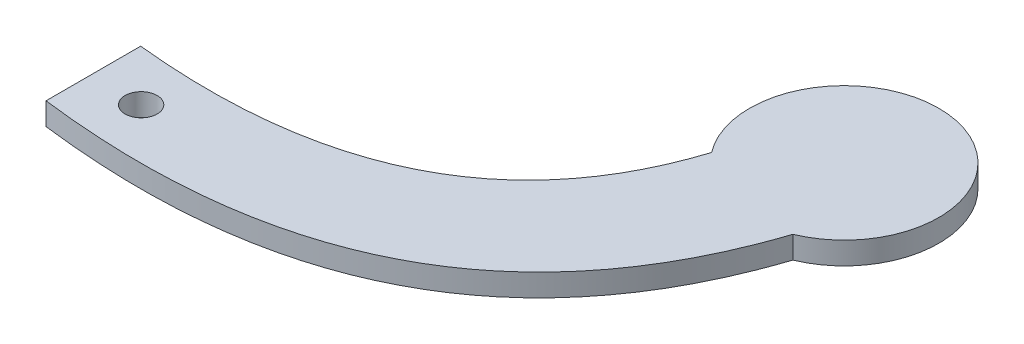
ISO-10303-21;
HEADER;
FILE_DESCRIPTION(('STEP AP214'),'2;1');
FILE_NAME('part.step','',(''),(''),'','','');
FILE_SCHEMA(('AUTOMOTIVE_DESIGN { 1 0 10303 214 1 1 1 1 }'));
ENDSEC;
DATA;
#1=APPLICATION_CONTEXT('core data for automotive mechanical design processes');
#2=APPLICATION_PROTOCOL_DEFINITION('international standard','automotive_design',2000,#1);
#3=PRODUCT_CONTEXT('',#1,'mechanical');
#4=PRODUCT('Part','Part','',(#3));
#5=PRODUCT_RELATED_PRODUCT_CATEGORY('part','',(#4));
#6=PRODUCT_DEFINITION_FORMATION('','',#4);
#7=PRODUCT_DEFINITION_CONTEXT('part definition',#1,'design');
#8=PRODUCT_DEFINITION('design','',#6,#7);
#9=PRODUCT_DEFINITION_SHAPE('','',#8);
#10=(LENGTH_UNIT() NAMED_UNIT(*) SI_UNIT(.MILLI.,.METRE.));
#11=(NAMED_UNIT(*) PLANE_ANGLE_UNIT() SI_UNIT($,.RADIAN.));
#12=(NAMED_UNIT(*) SI_UNIT($,.STERADIAN.) SOLID_ANGLE_UNIT());
#13=UNCERTAINTY_MEASURE_WITH_UNIT(LENGTH_MEASURE(1.E-05),#10,'distance_accuracy_value','');
#14=(GEOMETRIC_REPRESENTATION_CONTEXT(3) GLOBAL_UNCERTAINTY_ASSIGNED_CONTEXT((#13)) GLOBAL_UNIT_ASSIGNED_CONTEXT((#10,
#11,#12)) REPRESENTATION_CONTEXT('',''));
#15=CARTESIAN_POINT('',(0.,0.,0.));
#16=DIRECTION('',(0.,0.,1.));
#17=DIRECTION('',(1.,0.,0.));
#18=AXIS2_PLACEMENT_3D('',#15,#16,#17);
#19=CARTESIAN_POINT('',(14.2474531183386,3.,-35.0628266390555));
#20=CARTESIAN_POINT('',(6.48797833639178,3.,0.323288204531436));
#21=CARTESIAN_POINT('',(-37.6970430623458,3.,-4.28102058144157));
#22=B_SPLINE_CURVE_WITH_KNOTS('',2,(#19,#20,#21),.UNSPECIFIED.,.F.,.F.,(3,3),(0.,1.),.UNSPECIFIED.);
#23=DIRECTION('',(0.,-1.,0.));
#24=VECTOR('',#23,1.);
#25=SURFACE_OF_LINEAR_EXTRUSION('',#22,#24);
#26=DIRECTION('',(0.,-1.,0.));
#27=VECTOR('',#26,1.);
#28=CARTESIAN_POINT('',(12.956353612177,3.,-30.2218807816706));
#29=LINE('',#28,#27);
#30=CARTESIAN_POINT('',(12.956353612177,0.,-30.2218807816706));
#31=VERTEX_POINT('',#30);
#32=CARTESIAN_POINT('',(12.956353612177,3.,-30.2218807816706));
#33=VERTEX_POINT('',#32);
#34=EDGE_CURVE('E89',#31,#33,#29,.F.);
#35=ORIENTED_EDGE('',*,*,#34,.F.);
#36=CARTESIAN_POINT('',(14.2474531183386,0.,-35.0628266390555));
#37=CARTESIAN_POINT('',(6.48797833639178,0.,0.323288204531436));
#38=CARTESIAN_POINT('',(-37.6970430623458,0.,-4.28102058144157));
#39=B_SPLINE_CURVE_WITH_KNOTS('',2,(#36,#37,#38),.UNSPECIFIED.,.F.,.F.,(3,3),(0.,1.),.UNSPECIFIED.);
#40=CARTESIAN_POINT('',(-37.6970430623458,0.,-4.28102058144157));
#41=VERTEX_POINT('',#40);
#42=EDGE_CURVE('E87',#31,#41,#39,.T.);
#43=ORIENTED_EDGE('',*,*,#42,.T.);
#44=DIRECTION('',(0.,-1.,0.));
#45=VECTOR('',#44,1.);
#46=CARTESIAN_POINT('',(-37.6970430623458,3.,-4.28102058144157));
#47=LINE('',#46,#45);
#48=CARTESIAN_POINT('',(-37.6970430623458,3.,-4.28102058144157));
#49=VERTEX_POINT('',#48);
#50=EDGE_CURVE('E11',#49,#41,#47,.T.);
#51=ORIENTED_EDGE('',*,*,#50,.F.);
#52=EDGE_CURVE('E56',#33,#49,#22,.T.);
#53=ORIENTED_EDGE('',*,*,#52,.F.);
#54=EDGE_LOOP('',(#35,#43,#51,#53));
#55=FACE_BOUND('',#54,.T.);
#56=ADVANCED_FACE('F33',(#55),#25,.F.);
#57=CARTESIAN_POINT('',(-37.6970430623458,3.,8.41897941855843));
#58=CARTESIAN_POINT('',(17.3808980967986,3.,15.2774008467738));
#59=CARTESIAN_POINT('',(29.3686874513966,3.,-31.1236815606959));
#60=B_SPLINE_CURVE_WITH_KNOTS('',2,(#57,#58,#59),.UNSPECIFIED.,.F.,.F.,(3,3),(0.,1.),.UNSPECIFIED.);
#61=DIRECTION('',(0.,-1.,0.));
#62=VECTOR('',#61,1.);
#63=SURFACE_OF_LINEAR_EXTRUSION('',#60,#62);
#64=DIRECTION('',(0.,-1.,0.));
#65=VECTOR('',#64,1.);
#66=CARTESIAN_POINT('',(27.9183458636867,3.,-26.1766246286806));
#67=LINE('',#66,#65);
#68=CARTESIAN_POINT('',(27.9183458636867,3.,-26.1766246286806));
#69=VERTEX_POINT('',#68);
#70=CARTESIAN_POINT('',(27.9183458636867,0.,-26.1766246286806));
#71=VERTEX_POINT('',#70);
#72=EDGE_CURVE('E48',#69,#71,#67,.T.);
#73=ORIENTED_EDGE('',*,*,#72,.F.);
#74=CARTESIAN_POINT('',(-37.6970430623458,3.,8.41897941855843));
#75=VERTEX_POINT('',#74);
#76=EDGE_CURVE('E84',#75,#69,#60,.T.);
#77=ORIENTED_EDGE('',*,*,#76,.F.);
#78=DIRECTION('',(0.,-1.,0.));
#79=VECTOR('',#78,1.);
#80=CARTESIAN_POINT('',(-37.6970430623458,3.,8.41897941855843));
#81=LINE('',#80,#79);
#82=CARTESIAN_POINT('',(-37.6970430623458,0.,8.41897941855843));
#83=VERTEX_POINT('',#82);
#84=EDGE_CURVE('E41',#75,#83,#81,.T.);
#85=ORIENTED_EDGE('',*,*,#84,.T.);
#86=CARTESIAN_POINT('',(-37.6970430623458,0.,8.41897941855843));
#87=CARTESIAN_POINT('',(17.3808980967986,0.,15.2774008467738));
#88=CARTESIAN_POINT('',(29.3686874513966,0.,-31.1236815606959));
#89=B_SPLINE_CURVE_WITH_KNOTS('',2,(#86,#87,#88),.UNSPECIFIED.,.F.,.F.,(3,3),(0.,1.),.UNSPECIFIED.);
#90=EDGE_CURVE('E80',#83,#71,#89,.T.);
#91=ORIENTED_EDGE('',*,*,#90,.T.);
#92=EDGE_LOOP('',(#73,#77,#85,#91));
#93=FACE_BOUND('',#92,.T.);
#94=ADVANCED_FACE('F114',(#93),#63,.F.);
#95=CARTESIAN_POINT('',(-37.6970430623458,3.,-4.28102058144157));
#96=DIRECTION('',(1.,0.,0.));
#97=DIRECTION('',(0.,0.,-1.));
#98=AXIS2_PLACEMENT_3D('',#95,#96,#97);
#99=PLANE('',#98);
#100=DIRECTION('',(0.,0.,1.));
#101=VECTOR('',#100,1.);
#102=CARTESIAN_POINT('',(-37.6970430623458,0.,-4.28102058144157));
#103=LINE('',#102,#101);
#104=EDGE_CURVE('E93',#41,#83,#103,.T.);
#105=ORIENTED_EDGE('',*,*,#104,.T.);
#106=ORIENTED_EDGE('',*,*,#84,.F.);
#107=DIRECTION('',(0.,0.,1.));
#108=VECTOR('',#107,1.);
#109=CARTESIAN_POINT('',(-37.6970430623458,3.,-4.28102058144157));
#110=LINE('',#109,#108);
#111=EDGE_CURVE('E76',#49,#75,#110,.T.);
#112=ORIENTED_EDGE('',*,*,#111,.F.);
#113=ORIENTED_EDGE('',*,*,#50,.T.);
#114=EDGE_LOOP('',(#105,#106,#112,#113));
#115=FACE_BOUND('',#114,.T.);
#116=ADVANCED_FACE('F82',(#115),#99,.F.);
#117=CARTESIAN_POINT('',(-2.61840831780591,3.,-9.67431770285855));
#118=DIRECTION('',(0.,-1.,0.));
#119=DIRECTION('',(0.,0.,-1.));
#120=AXIS2_PLACEMENT_3D('',#117,#118,#119);
#121=PLANE('',#120);
#122=CARTESIAN_POINT('',(-30.8552036088178,3.,2.49606383489245));
#123=DIRECTION('',(0.,1.,0.));
#124=DIRECTION('',(0.,0.,1.));
#125=AXIS2_PLACEMENT_3D('',#122,#123,#124);
#126=CIRCLE('',#125,2.15265);
#127=CARTESIAN_POINT('',(-30.8552036088178,3.,4.64871383489245));
#128=VERTEX_POINT('',#127);
#129=EDGE_CURVE('E176',#128,#128,#126,.T.);
#130=ORIENTED_EDGE('',*,*,#129,.F.);
#131=EDGE_LOOP('',(#130));
#132=FACE_BOUND('',#131,.T.);
#133=CARTESIAN_POINT('',(23.0633764700689,3.,-37.9120101011326));
#134=DIRECTION('',(0.,1.,0.));
#135=DIRECTION('',(0.,0.,1.));
#136=AXIS2_PLACEMENT_3D('',#133,#134,#135);
#137=CIRCLE('',#136,12.7);
#138=EDGE_CURVE('E79',#69,#33,#137,.T.);
#139=ORIENTED_EDGE('',*,*,#138,.T.);
#140=ORIENTED_EDGE('',*,*,#52,.T.);
#141=ORIENTED_EDGE('',*,*,#111,.T.);
#142=ORIENTED_EDGE('',*,*,#76,.T.);
#143=EDGE_LOOP('',(#139,#140,#141,#142));
#144=FACE_BOUND('',#143,.T.);
#145=ADVANCED_FACE('F75',(#132,#144),#121,.F.);
#146=CARTESIAN_POINT('',(-2.61840831780591,0.,-9.67431770285855));
#147=DIRECTION('',(0.,-1.,0.));
#148=DIRECTION('',(0.,0.,-1.));
#149=AXIS2_PLACEMENT_3D('',#146,#147,#148);
#150=PLANE('',#149);
#151=CARTESIAN_POINT('',(-30.8552036088178,0.,2.49606383489245));
#152=DIRECTION('',(0.,1.,0.));
#153=DIRECTION('',(0.,0.,1.));
#154=AXIS2_PLACEMENT_3D('',#151,#152,#153);
#155=CIRCLE('',#154,2.15265);
#156=CARTESIAN_POINT('',(-30.8552036088178,0.,4.64871383489245));
#157=VERTEX_POINT('',#156);
#158=EDGE_CURVE('E173',#157,#157,#155,.T.);
#159=ORIENTED_EDGE('',*,*,#158,.T.);
#160=EDGE_LOOP('',(#159));
#161=FACE_BOUND('',#160,.T.);
#162=ORIENTED_EDGE('',*,*,#42,.F.);
#163=CARTESIAN_POINT('',(23.0633764700689,0.,-37.9120101011326));
#164=DIRECTION('',(0.,1.,0.));
#165=DIRECTION('',(0.,0.,1.));
#166=AXIS2_PLACEMENT_3D('',#163,#164,#165);
#167=CIRCLE('',#166,12.7);
#168=EDGE_CURVE('E178',#71,#31,#167,.T.);
#169=ORIENTED_EDGE('',*,*,#168,.F.);
#170=ORIENTED_EDGE('',*,*,#90,.F.);
#171=ORIENTED_EDGE('',*,*,#104,.F.);
#172=EDGE_LOOP('',(#162,#169,#170,#171));
#173=FACE_BOUND('',#172,.T.);
#174=ADVANCED_FACE('F96',(#161,#173),#150,.T.);
#175=CARTESIAN_POINT('',(23.0633764700689,3.,-37.9120101011326));
#176=DIRECTION('',(0.,-1.,0.));
#177=DIRECTION('',(0.,0.,-1.));
#178=AXIS2_PLACEMENT_3D('',#175,#176,#177);
#179=CYLINDRICAL_SURFACE('',#178,12.7);
#180=ORIENTED_EDGE('',*,*,#168,.T.);
#181=ORIENTED_EDGE('',*,*,#34,.T.);
#182=ORIENTED_EDGE('',*,*,#138,.F.);
#183=ORIENTED_EDGE('',*,*,#72,.T.);
#184=EDGE_LOOP('',(#180,#181,#182,#183));
#185=FACE_BOUND('',#184,.T.);
#186=ADVANCED_FACE('F136',(#185),#179,.T.);
#187=CARTESIAN_POINT('',(-30.8552036088178,3.,2.49606383489245));
#188=DIRECTION('',(0.,1.,0.));
#189=DIRECTION('',(0.,0.,1.));
#190=AXIS2_PLACEMENT_3D('',#187,#188,#189);
#191=CYLINDRICAL_SURFACE('',#190,2.15265);
#192=ORIENTED_EDGE('',*,*,#158,.F.);
#193=EDGE_LOOP('',(#192));
#194=FACE_BOUND('',#193,.T.);
#195=ORIENTED_EDGE('',*,*,#129,.T.);
#196=EDGE_LOOP('',(#195));
#197=FACE_BOUND('',#196,.T.);
#198=ADVANCED_FACE('F141',(#194,#197),#191,.F.);
#199=CLOSED_SHELL('',(#56,#94,#116,#145,#174,#186,#198));
#200=MANIFOLD_SOLID_BREP('B2',#199);
#201=ADVANCED_BREP_SHAPE_REPRESENTATION('',(#18,#200),#14);
#202=SHAPE_DEFINITION_REPRESENTATION(#9,#201);
ENDSEC;
END-ISO-10303-21;
